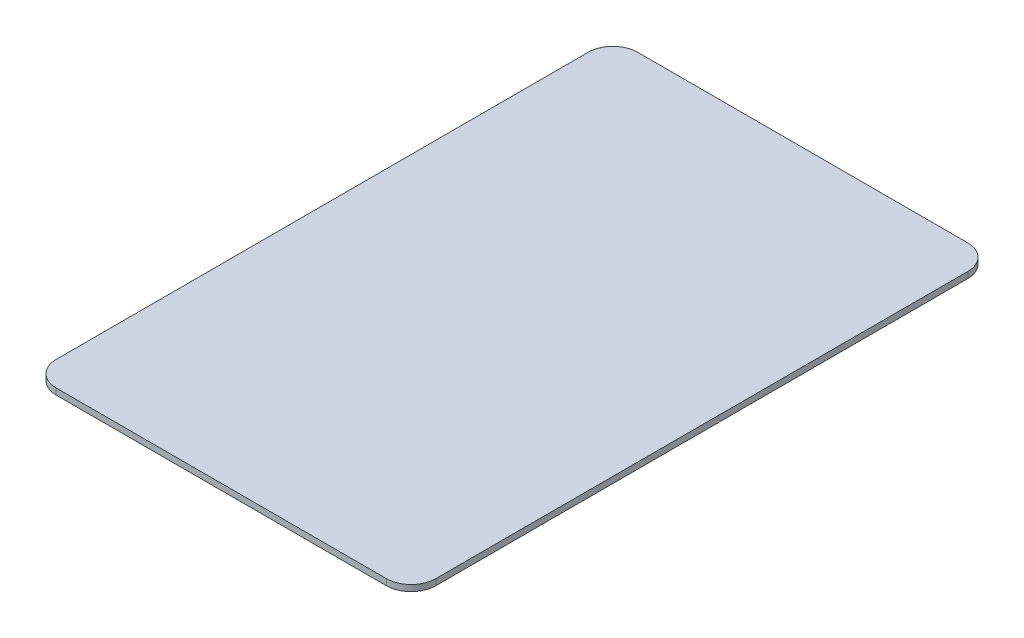
ISO-10303-21;
HEADER;
FILE_DESCRIPTION(('STEP AP214'),'2;1');
FILE_NAME('part.step','',(''),(''),'','','');
FILE_SCHEMA(('AUTOMOTIVE_DESIGN { 1 0 10303 214 1 1 1 1 }'));
ENDSEC;
DATA;
#1=APPLICATION_CONTEXT('core data for automotive mechanical design processes');
#2=APPLICATION_PROTOCOL_DEFINITION('international standard','automotive_design',2000,#1);
#3=PRODUCT_CONTEXT('',#1,'mechanical');
#4=PRODUCT('Part','Part','',(#3));
#5=PRODUCT_RELATED_PRODUCT_CATEGORY('part','',(#4));
#6=PRODUCT_DEFINITION_FORMATION('','',#4);
#7=PRODUCT_DEFINITION_CONTEXT('part definition',#1,'design');
#8=PRODUCT_DEFINITION('design','',#6,#7);
#9=PRODUCT_DEFINITION_SHAPE('','',#8);
#10=(LENGTH_UNIT() NAMED_UNIT(*) SI_UNIT(.MILLI.,.METRE.));
#11=(NAMED_UNIT(*) PLANE_ANGLE_UNIT() SI_UNIT($,.RADIAN.));
#12=(NAMED_UNIT(*) SI_UNIT($,.STERADIAN.) SOLID_ANGLE_UNIT());
#13=UNCERTAINTY_MEASURE_WITH_UNIT(LENGTH_MEASURE(1.E-05),#10,'distance_accuracy_value','');
#14=(GEOMETRIC_REPRESENTATION_CONTEXT(3) GLOBAL_UNCERTAINTY_ASSIGNED_CONTEXT((#13)) GLOBAL_UNIT_ASSIGNED_CONTEXT((#10,
#11,#12)) REPRESENTATION_CONTEXT('',''));
#15=CARTESIAN_POINT('',(0.,0.,0.));
#16=DIRECTION('',(0.,0.,1.));
#17=DIRECTION('',(1.,0.,0.));
#18=AXIS2_PLACEMENT_3D('',#15,#16,#17);
#19=CARTESIAN_POINT('',(0.,-1.5875,0.));
#20=DIRECTION('',(-1.,0.,0.));
#21=DIRECTION('',(0.,0.,1.));
#22=AXIS2_PLACEMENT_3D('',#19,#20,#21);
#23=PLANE('',#22);
#24=DIRECTION('',(0.,0.,1.));
#25=VECTOR('',#24,1.);
#26=CARTESIAN_POINT('',(0.,0.,0.));
#27=LINE('',#26,#25);
#28=CARTESIAN_POINT('',(0.,0.,-142.875));
#29=VERTEX_POINT('',#28);
#30=CARTESIAN_POINT('',(0.,0.,-6.35));
#31=VERTEX_POINT('',#30);
#32=EDGE_CURVE('E160',#29,#31,#27,.T.);
#33=ORIENTED_EDGE('',*,*,#32,.F.);
#34=DIRECTION('',(0.,1.,0.));
#35=VECTOR('',#34,1.);
#36=CARTESIAN_POINT('',(0.,-1.5875,-142.875));
#37=LINE('',#36,#35);
#38=CARTESIAN_POINT('',(0.,-1.5875,-142.875));
#39=VERTEX_POINT('',#38);
#40=EDGE_CURVE('E141',#29,#39,#37,.F.);
#41=ORIENTED_EDGE('',*,*,#40,.T.);
#42=DIRECTION('',(0.,0.,1.));
#43=VECTOR('',#42,1.);
#44=CARTESIAN_POINT('',(0.,-1.5875,0.));
#45=LINE('',#44,#43);
#46=CARTESIAN_POINT('',(0.,-1.5875,-6.35));
#47=VERTEX_POINT('',#46);
#48=EDGE_CURVE('E122',#39,#47,#45,.T.);
#49=ORIENTED_EDGE('',*,*,#48,.T.);
#50=DIRECTION('',(0.,1.,0.));
#51=VECTOR('',#50,1.);
#52=CARTESIAN_POINT('',(0.,-1.5875,-6.35));
#53=LINE('',#52,#51);
#54=EDGE_CURVE('E138',#47,#31,#53,.T.);
#55=ORIENTED_EDGE('',*,*,#54,.T.);
#56=EDGE_LOOP('',(#33,#41,#49,#55));
#57=FACE_BOUND('',#56,.T.);
#58=ADVANCED_FACE('F36',(#57),#23,.T.);
#59=CARTESIAN_POINT('',(0.,-1.5875,-149.225));
#60=DIRECTION('',(0.,0.,-1.));
#61=DIRECTION('',(-1.,0.,0.));
#62=AXIS2_PLACEMENT_3D('',#59,#60,#61);
#63=PLANE('',#62);
#64=DIRECTION('',(-1.,0.,0.));
#65=VECTOR('',#64,1.);
#66=CARTESIAN_POINT('',(0.,-1.5875,-149.225));
#67=LINE('',#66,#65);
#68=CARTESIAN_POINT('',(91.07424,-1.5875,-149.225));
#69=VERTEX_POINT('',#68);
#70=CARTESIAN_POINT('',(6.35,-1.5875,-149.225));
#71=VERTEX_POINT('',#70);
#72=EDGE_CURVE('E127',#69,#71,#67,.T.);
#73=ORIENTED_EDGE('',*,*,#72,.T.);
#74=DIRECTION('',(0.,1.,0.));
#75=VECTOR('',#74,1.);
#76=CARTESIAN_POINT('',(6.35,-1.5875,-149.225));
#77=LINE('',#76,#75);
#78=CARTESIAN_POINT('',(6.35,0.,-149.225));
#79=VERTEX_POINT('',#78);
#80=EDGE_CURVE('E121',#71,#79,#77,.T.);
#81=ORIENTED_EDGE('',*,*,#80,.T.);
#82=DIRECTION('',(-1.,0.,0.));
#83=VECTOR('',#82,1.);
#84=CARTESIAN_POINT('',(0.,0.,-149.225));
#85=LINE('',#84,#83);
#86=CARTESIAN_POINT('',(91.07424,0.,-149.225));
#87=VERTEX_POINT('',#86);
#88=EDGE_CURVE('E104',#87,#79,#85,.T.);
#89=ORIENTED_EDGE('',*,*,#88,.F.);
#90=DIRECTION('',(0.,1.,0.));
#91=VECTOR('',#90,1.);
#92=CARTESIAN_POINT('',(91.07424,-1.5875,-149.225));
#93=LINE('',#92,#91);
#94=EDGE_CURVE('E118',#87,#69,#93,.F.);
#95=ORIENTED_EDGE('',*,*,#94,.T.);
#96=EDGE_LOOP('',(#73,#81,#89,#95));
#97=FACE_BOUND('',#96,.T.);
#98=ADVANCED_FACE('F117',(#97),#63,.T.);
#99=CARTESIAN_POINT('',(97.42424,-1.5875,0.));
#100=DIRECTION('',(1.,0.,0.));
#101=DIRECTION('',(0.,0.,-1.));
#102=AXIS2_PLACEMENT_3D('',#99,#100,#101);
#103=PLANE('',#102);
#104=DIRECTION('',(0.,0.,-1.));
#105=VECTOR('',#104,1.);
#106=CARTESIAN_POINT('',(97.42424,-1.5875,0.));
#107=LINE('',#106,#105);
#108=CARTESIAN_POINT('',(97.42424,-1.5875,-6.35));
#109=VERTEX_POINT('',#108);
#110=CARTESIAN_POINT('',(97.42424,-1.5875,-142.875));
#111=VERTEX_POINT('',#110);
#112=EDGE_CURVE('E131',#109,#111,#107,.T.);
#113=ORIENTED_EDGE('',*,*,#112,.T.);
#114=DIRECTION('',(0.,1.,0.));
#115=VECTOR('',#114,1.);
#116=CARTESIAN_POINT('',(97.42424,-1.5875,-142.875));
#117=LINE('',#116,#115);
#118=CARTESIAN_POINT('',(97.42424,0.,-142.875));
#119=VERTEX_POINT('',#118);
#120=EDGE_CURVE('E151',#111,#119,#117,.T.);
#121=ORIENTED_EDGE('',*,*,#120,.T.);
#122=DIRECTION('',(0.,0.,-1.));
#123=VECTOR('',#122,1.);
#124=CARTESIAN_POINT('',(97.42424,0.,0.));
#125=LINE('',#124,#123);
#126=CARTESIAN_POINT('',(97.42424,0.,-6.35));
#127=VERTEX_POINT('',#126);
#128=EDGE_CURVE('E106',#127,#119,#125,.T.);
#129=ORIENTED_EDGE('',*,*,#128,.F.);
#130=DIRECTION('',(0.,1.,0.));
#131=VECTOR('',#130,1.);
#132=CARTESIAN_POINT('',(97.42424,-1.5875,-6.35));
#133=LINE('',#132,#131);
#134=EDGE_CURVE('E149',#127,#109,#133,.F.);
#135=ORIENTED_EDGE('',*,*,#134,.T.);
#136=EDGE_LOOP('',(#113,#121,#129,#135));
#137=FACE_BOUND('',#136,.T.);
#138=ADVANCED_FACE('F186',(#137),#103,.T.);
#139=CARTESIAN_POINT('',(0.,-1.5875,0.));
#140=DIRECTION('',(0.,0.,1.));
#141=DIRECTION('',(1.,0.,0.));
#142=AXIS2_PLACEMENT_3D('',#139,#140,#141);
#143=PLANE('',#142);
#144=DIRECTION('',(1.,0.,0.));
#145=VECTOR('',#144,1.);
#146=CARTESIAN_POINT('',(0.,0.,0.));
#147=LINE('',#146,#145);
#148=CARTESIAN_POINT('',(6.35,0.,0.));
#149=VERTEX_POINT('',#148);
#150=CARTESIAN_POINT('',(91.07424,0.,0.));
#151=VERTEX_POINT('',#150);
#152=EDGE_CURVE('E156',#149,#151,#147,.T.);
#153=ORIENTED_EDGE('',*,*,#152,.F.);
#154=DIRECTION('',(0.,1.,0.));
#155=VECTOR('',#154,1.);
#156=CARTESIAN_POINT('',(6.35,-1.5875,0.));
#157=LINE('',#156,#155);
#158=CARTESIAN_POINT('',(6.35,-1.5875,0.));
#159=VERTEX_POINT('',#158);
#160=EDGE_CURVE('E11',#149,#159,#157,.F.);
#161=ORIENTED_EDGE('',*,*,#160,.T.);
#162=DIRECTION('',(1.,0.,0.));
#163=VECTOR('',#162,1.);
#164=CARTESIAN_POINT('',(0.,-1.5875,0.));
#165=LINE('',#164,#163);
#166=CARTESIAN_POINT('',(91.07424,-1.5875,0.));
#167=VERTEX_POINT('',#166);
#168=EDGE_CURVE('E157',#159,#167,#165,.T.);
#169=ORIENTED_EDGE('',*,*,#168,.T.);
#170=DIRECTION('',(0.,1.,0.));
#171=VECTOR('',#170,1.);
#172=CARTESIAN_POINT('',(91.07424,-1.5875,0.));
#173=LINE('',#172,#171);
#174=EDGE_CURVE('E44',#167,#151,#173,.T.);
#175=ORIENTED_EDGE('',*,*,#174,.T.);
#176=EDGE_LOOP('',(#153,#161,#169,#175));
#177=FACE_BOUND('',#176,.T.);
#178=ADVANCED_FACE('F155',(#177),#143,.T.);
#179=CARTESIAN_POINT('',(0.,-1.5875,0.));
#180=DIRECTION('',(0.,-1.,0.));
#181=DIRECTION('',(0.,0.,-1.));
#182=AXIS2_PLACEMENT_3D('',#179,#180,#181);
#183=PLANE('',#182);
#184=ORIENTED_EDGE('',*,*,#48,.F.);
#185=CARTESIAN_POINT('',(6.35,-1.5875,-142.875));
#186=DIRECTION('',(0.,-1.,0.));
#187=DIRECTION('',(0.,0.,-1.));
#188=AXIS2_PLACEMENT_3D('',#185,#186,#187);
#189=CIRCLE('',#188,6.35);
#190=EDGE_CURVE('E147',#39,#71,#189,.T.);
#191=ORIENTED_EDGE('',*,*,#190,.T.);
#192=ORIENTED_EDGE('',*,*,#72,.F.);
#193=CARTESIAN_POINT('',(91.07424,-1.5875,-142.875));
#194=DIRECTION('',(0.,-1.,0.));
#195=DIRECTION('',(0.,0.,-1.));
#196=AXIS2_PLACEMENT_3D('',#193,#194,#195);
#197=CIRCLE('',#196,6.35);
#198=EDGE_CURVE('E126',#69,#111,#197,.T.);
#199=ORIENTED_EDGE('',*,*,#198,.T.);
#200=ORIENTED_EDGE('',*,*,#112,.F.);
#201=CARTESIAN_POINT('',(91.07424,-1.5875,-6.35));
#202=DIRECTION('',(0.,-1.,0.));
#203=DIRECTION('',(0.,0.,-1.));
#204=AXIS2_PLACEMENT_3D('',#201,#202,#203);
#205=CIRCLE('',#204,6.35);
#206=EDGE_CURVE('E51',#109,#167,#205,.T.);
#207=ORIENTED_EDGE('',*,*,#206,.T.);
#208=ORIENTED_EDGE('',*,*,#168,.F.);
#209=CARTESIAN_POINT('',(6.35,-1.5875,-6.35));
#210=DIRECTION('',(0.,-1.,0.));
#211=DIRECTION('',(0.,0.,-1.));
#212=AXIS2_PLACEMENT_3D('',#209,#210,#211);
#213=CIRCLE('',#212,6.35);
#214=EDGE_CURVE('E144',#159,#47,#213,.T.);
#215=ORIENTED_EDGE('',*,*,#214,.T.);
#216=EDGE_LOOP('',(#184,#191,#192,#199,#200,#207,#208,#215));
#217=FACE_BOUND('',#216,.T.);
#218=ADVANCED_FACE('F177',(#217),#183,.T.);
#219=CARTESIAN_POINT('',(0.,0.,0.));
#220=DIRECTION('',(0.,-1.,0.));
#221=DIRECTION('',(0.,0.,-1.));
#222=AXIS2_PLACEMENT_3D('',#219,#220,#221);
#223=PLANE('',#222);
#224=ORIENTED_EDGE('',*,*,#88,.T.);
#225=CARTESIAN_POINT('',(6.35,0.,-142.875));
#226=DIRECTION('',(0.,-1.,0.));
#227=DIRECTION('',(0.,0.,-1.));
#228=AXIS2_PLACEMENT_3D('',#225,#226,#227);
#229=CIRCLE('',#228,6.35);
#230=EDGE_CURVE('E111',#79,#29,#229,.F.);
#231=ORIENTED_EDGE('',*,*,#230,.T.);
#232=ORIENTED_EDGE('',*,*,#32,.T.);
#233=CARTESIAN_POINT('',(6.35,0.,-6.35));
#234=DIRECTION('',(0.,-1.,0.));
#235=DIRECTION('',(0.,0.,-1.));
#236=AXIS2_PLACEMENT_3D('',#233,#234,#235);
#237=CIRCLE('',#236,6.35);
#238=EDGE_CURVE('E112',#31,#149,#237,.F.);
#239=ORIENTED_EDGE('',*,*,#238,.T.);
#240=ORIENTED_EDGE('',*,*,#152,.T.);
#241=CARTESIAN_POINT('',(91.07424,0.,-6.35));
#242=DIRECTION('',(0.,-1.,0.));
#243=DIRECTION('',(0.,0.,-1.));
#244=AXIS2_PLACEMENT_3D('',#241,#242,#243);
#245=CIRCLE('',#244,6.35);
#246=EDGE_CURVE('E129',#151,#127,#245,.F.);
#247=ORIENTED_EDGE('',*,*,#246,.T.);
#248=ORIENTED_EDGE('',*,*,#128,.T.);
#249=CARTESIAN_POINT('',(91.07424,0.,-142.875));
#250=DIRECTION('',(0.,-1.,0.));
#251=DIRECTION('',(0.,0.,-1.));
#252=AXIS2_PLACEMENT_3D('',#249,#250,#251);
#253=CIRCLE('',#252,6.35);
#254=EDGE_CURVE('E101',#119,#87,#253,.F.);
#255=ORIENTED_EDGE('',*,*,#254,.T.);
#256=EDGE_LOOP('',(#224,#231,#232,#239,#240,#247,#248,#255));
#257=FACE_BOUND('',#256,.T.);
#258=ADVANCED_FACE('F103',(#257),#223,.F.);
#259=CARTESIAN_POINT('',(6.35,-1.5875,-142.875));
#260=DIRECTION('',(0.,1.,0.));
#261=DIRECTION('',(0.,0.,1.));
#262=AXIS2_PLACEMENT_3D('',#259,#260,#261);
#263=CYLINDRICAL_SURFACE('',#262,6.35);
#264=ORIENTED_EDGE('',*,*,#190,.F.);
#265=ORIENTED_EDGE('',*,*,#40,.F.);
#266=ORIENTED_EDGE('',*,*,#230,.F.);
#267=ORIENTED_EDGE('',*,*,#80,.F.);
#268=EDGE_LOOP('',(#264,#265,#266,#267));
#269=FACE_BOUND('',#268,.T.);
#270=ADVANCED_FACE('F184',(#269),#263,.T.);
#271=CARTESIAN_POINT('',(91.07424,-1.5875,-142.875));
#272=DIRECTION('',(0.,1.,0.));
#273=DIRECTION('',(0.,0.,1.));
#274=AXIS2_PLACEMENT_3D('',#271,#272,#273);
#275=CYLINDRICAL_SURFACE('',#274,6.35);
#276=ORIENTED_EDGE('',*,*,#198,.F.);
#277=ORIENTED_EDGE('',*,*,#94,.F.);
#278=ORIENTED_EDGE('',*,*,#254,.F.);
#279=ORIENTED_EDGE('',*,*,#120,.F.);
#280=EDGE_LOOP('',(#276,#277,#278,#279));
#281=FACE_BOUND('',#280,.T.);
#282=ADVANCED_FACE('F125',(#281),#275,.T.);
#283=CARTESIAN_POINT('',(6.35,-1.5875,-6.35));
#284=DIRECTION('',(0.,1.,0.));
#285=DIRECTION('',(0.,0.,1.));
#286=AXIS2_PLACEMENT_3D('',#283,#284,#285);
#287=CYLINDRICAL_SURFACE('',#286,6.35);
#288=ORIENTED_EDGE('',*,*,#214,.F.);
#289=ORIENTED_EDGE('',*,*,#160,.F.);
#290=ORIENTED_EDGE('',*,*,#238,.F.);
#291=ORIENTED_EDGE('',*,*,#54,.F.);
#292=EDGE_LOOP('',(#288,#289,#290,#291));
#293=FACE_BOUND('',#292,.T.);
#294=ADVANCED_FACE('F176',(#293),#287,.T.);
#295=CARTESIAN_POINT('',(91.07424,-1.5875,-6.35));
#296=DIRECTION('',(0.,1.,0.));
#297=DIRECTION('',(0.,0.,1.));
#298=AXIS2_PLACEMENT_3D('',#295,#296,#297);
#299=CYLINDRICAL_SURFACE('',#298,6.35);
#300=ORIENTED_EDGE('',*,*,#206,.F.);
#301=ORIENTED_EDGE('',*,*,#134,.F.);
#302=ORIENTED_EDGE('',*,*,#246,.F.);
#303=ORIENTED_EDGE('',*,*,#174,.F.);
#304=EDGE_LOOP('',(#300,#301,#302,#303));
#305=FACE_BOUND('',#304,.T.);
#306=ADVANCED_FACE('F38',(#305),#299,.T.);
#307=CLOSED_SHELL('',(#58,#98,#138,#178,#218,#258,#270,#282,#294,#306));
#308=MANIFOLD_SOLID_BREP('B2',#307);
#309=ADVANCED_BREP_SHAPE_REPRESENTATION('',(#18,#308),#14);
#310=SHAPE_DEFINITION_REPRESENTATION(#9,#309);
ENDSEC;
END-ISO-10303-21;
